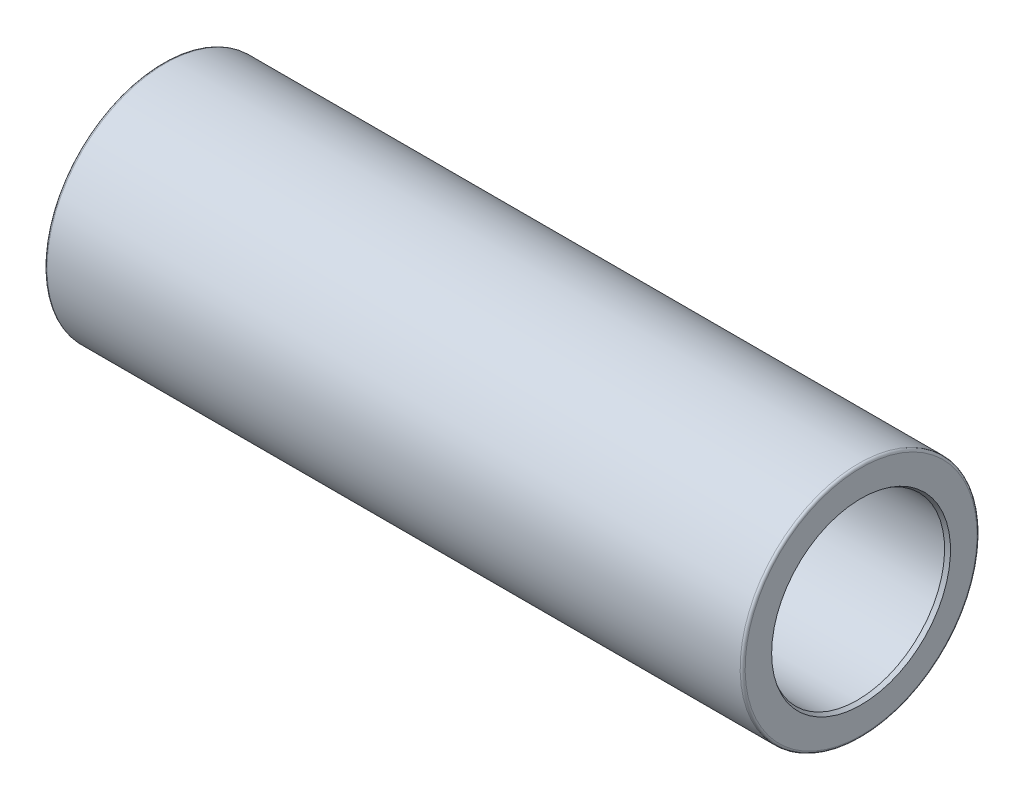
ISO-10303-21;
HEADER;
FILE_DESCRIPTION(('STEP AP214'),'2;1');
FILE_NAME('part.step','',(''),(''),'','','');
FILE_SCHEMA(('AUTOMOTIVE_DESIGN { 1 0 10303 214 1 1 1 1 }'));
ENDSEC;
DATA;
#1=APPLICATION_CONTEXT('core data for automotive mechanical design processes');
#2=APPLICATION_PROTOCOL_DEFINITION('international standard','automotive_design',2000,#1);
#3=PRODUCT_CONTEXT('',#1,'mechanical');
#4=PRODUCT('Part','Part','',(#3));
#5=PRODUCT_RELATED_PRODUCT_CATEGORY('part','',(#4));
#6=PRODUCT_DEFINITION_FORMATION('','',#4);
#7=PRODUCT_DEFINITION_CONTEXT('part definition',#1,'design');
#8=PRODUCT_DEFINITION('design','',#6,#7);
#9=PRODUCT_DEFINITION_SHAPE('','',#8);
#10=(LENGTH_UNIT() NAMED_UNIT(*) SI_UNIT(.MILLI.,.METRE.));
#11=(NAMED_UNIT(*) PLANE_ANGLE_UNIT() SI_UNIT($,.RADIAN.));
#12=(NAMED_UNIT(*) SI_UNIT($,.STERADIAN.) SOLID_ANGLE_UNIT());
#13=UNCERTAINTY_MEASURE_WITH_UNIT(LENGTH_MEASURE(1.E-05),#10,'distance_accuracy_value','');
#14=(GEOMETRIC_REPRESENTATION_CONTEXT(3) GLOBAL_UNCERTAINTY_ASSIGNED_CONTEXT((#13)) GLOBAL_UNIT_ASSIGNED_CONTEXT((#10,
#11,#12)) REPRESENTATION_CONTEXT('',''));
#15=CARTESIAN_POINT('',(0.,0.,0.));
#16=DIRECTION('',(0.,0.,1.));
#17=DIRECTION('',(1.,0.,0.));
#18=AXIS2_PLACEMENT_3D('',#15,#16,#17);
#19=CARTESIAN_POINT('',(-140.,2.22044604925031E-13,0.));
#20=DIRECTION('',(-1.,0.,0.));
#21=DIRECTION('',(0.,-1.,0.));
#22=AXIS2_PLACEMENT_3D('',#19,#20,#21);
#23=CYLINDRICAL_SURFACE('',#22,35.);
#24=CARTESIAN_POINT('',(-73.4626105055054,2.22044604925031E-13,0.));
#25=DIRECTION('',(-1.,0.,0.));
#26=DIRECTION('',(0.,-1.,0.));
#27=AXIS2_PLACEMENT_3D('',#24,#25,#26);
#28=CIRCLE('',#27,35.);
#29=CARTESIAN_POINT('',(-73.4626105055054,-34.9999999999998,0.));
#30=VERTEX_POINT('',#29);
#31=EDGE_CURVE('E10',#30,#30,#28,.T.);
#32=ORIENTED_EDGE('',*,*,#31,.F.);
#33=EDGE_LOOP('',(#32));
#34=FACE_BOUND('',#33,.T.);
#35=CARTESIAN_POINT('',(-138.5,2.22044604925031E-13,0.));
#36=DIRECTION('',(-1.,0.,0.));
#37=DIRECTION('',(0.,0.,1.));
#38=AXIS2_PLACEMENT_3D('',#35,#36,#37);
#39=CIRCLE('',#38,35.);
#40=CARTESIAN_POINT('',(-138.5,2.22044604925031E-13,35.0000000000001));
#41=VERTEX_POINT('',#40);
#42=EDGE_CURVE('E112',#41,#41,#39,.T.);
#43=ORIENTED_EDGE('',*,*,#42,.T.);
#44=EDGE_LOOP('',(#43));
#45=FACE_BOUND('',#44,.T.);
#46=ADVANCED_FACE('F39',(#34,#45),#23,.F.);
#47=CARTESIAN_POINT('',(-140.,35.0000000000001,0.));
#48=DIRECTION('',(-1.,0.,0.));
#49=DIRECTION('',(0.,-1.,0.));
#50=AXIS2_PLACEMENT_3D('',#47,#48,#49);
#51=PLANE('',#50);
#52=CARTESIAN_POINT('',(-140.,2.22044604925031E-13,0.));
#53=DIRECTION('',(-1.,0.,0.));
#54=DIRECTION('',(0.,-1.,0.));
#55=AXIS2_PLACEMENT_3D('',#52,#53,#54);
#56=CIRCLE('',#55,46.5);
#57=CARTESIAN_POINT('',(-140.,-46.4999999999999,0.));
#58=VERTEX_POINT('',#57);
#59=EDGE_CURVE('E103',#58,#58,#56,.T.);
#60=ORIENTED_EDGE('',*,*,#59,.T.);
#61=EDGE_LOOP('',(#60));
#62=FACE_BOUND('',#61,.T.);
#63=CARTESIAN_POINT('',(-140.,2.22044604925031E-13,0.));
#64=DIRECTION('',(-1.,0.,0.));
#65=DIRECTION('',(0.,0.,1.));
#66=AXIS2_PLACEMENT_3D('',#63,#64,#65);
#67=CIRCLE('',#66,35.8660254037845);
#68=CARTESIAN_POINT('',(-140.,2.22044604925031E-13,35.8660254037845));
#69=VERTEX_POINT('',#68);
#70=EDGE_CURVE('E115',#69,#69,#67,.T.);
#71=ORIENTED_EDGE('',*,*,#70,.F.);
#72=EDGE_LOOP('',(#71));
#73=FACE_BOUND('',#72,.T.);
#74=ADVANCED_FACE('F122',(#62,#73),#51,.T.);
#75=CARTESIAN_POINT('',(-140.,2.22044604925031E-13,0.));
#76=DIRECTION('',(-1.,0.,0.));
#77=DIRECTION('',(0.,-1.,0.));
#78=AXIS2_PLACEMENT_3D('',#75,#76,#77);
#79=CYLINDRICAL_SURFACE('',#78,35.);
#80=CARTESIAN_POINT('',(73.462610505505,1.11022302462516E-13,2.22044604925031E-13));
#81=DIRECTION('',(-1.,0.,0.));
#82=DIRECTION('',(0.,-1.,0.));
#83=AXIS2_PLACEMENT_3D('',#80,#81,#82);
#84=CIRCLE('',#83,35.);
#85=CARTESIAN_POINT('',(73.462610505505,-35.,2.14273043752655E-13));
#86=VERTEX_POINT('',#85);
#87=EDGE_CURVE('E91',#86,#86,#84,.T.);
#88=ORIENTED_EDGE('',*,*,#87,.T.);
#89=EDGE_LOOP('',(#88));
#90=FACE_BOUND('',#89,.T.);
#91=CARTESIAN_POINT('',(138.5,3.33066907387547E-13,0.));
#92=DIRECTION('',(-1.,0.,0.));
#93=DIRECTION('',(0.,0.,1.));
#94=AXIS2_PLACEMENT_3D('',#91,#92,#93);
#95=CIRCLE('',#94,35.);
#96=CARTESIAN_POINT('',(138.5,3.33066907387547E-13,35.0000000000001));
#97=VERTEX_POINT('',#96);
#98=EDGE_CURVE('E109',#97,#97,#95,.T.);
#99=ORIENTED_EDGE('',*,*,#98,.F.);
#100=EDGE_LOOP('',(#99));
#101=FACE_BOUND('',#100,.T.);
#102=ADVANCED_FACE('F124',(#90,#101),#79,.F.);
#103=CARTESIAN_POINT('',(140.,35.,0.));
#104=DIRECTION('',(-1.,0.,0.));
#105=DIRECTION('',(0.,-1.,0.));
#106=AXIS2_PLACEMENT_3D('',#103,#104,#105);
#107=PLANE('',#106);
#108=CARTESIAN_POINT('',(140.,1.11022302462516E-13,2.22044604925031E-13));
#109=DIRECTION('',(-1.,0.,0.));
#110=DIRECTION('',(0.,-1.,0.));
#111=AXIS2_PLACEMENT_3D('',#108,#109,#110);
#112=CIRCLE('',#111,46.5);
#113=CARTESIAN_POINT('',(140.,-46.5,2.11719530796017E-13));
#114=VERTEX_POINT('',#113);
#115=EDGE_CURVE('E94',#114,#114,#112,.T.);
#116=ORIENTED_EDGE('',*,*,#115,.F.);
#117=EDGE_LOOP('',(#116));
#118=FACE_BOUND('',#117,.T.);
#119=CARTESIAN_POINT('',(140.,1.11022302462516E-13,2.22044604925031E-13));
#120=DIRECTION('',(-1.,0.,0.));
#121=DIRECTION('',(0.,0.,1.));
#122=AXIS2_PLACEMENT_3D('',#119,#120,#121);
#123=CIRCLE('',#122,35.8660254037845);
#124=CARTESIAN_POINT('',(140.,1.11022302462516E-13,35.8660254037848));
#125=VERTEX_POINT('',#124);
#126=EDGE_CURVE('E106',#125,#125,#123,.T.);
#127=ORIENTED_EDGE('',*,*,#126,.T.);
#128=EDGE_LOOP('',(#127));
#129=FACE_BOUND('',#128,.T.);
#130=ADVANCED_FACE('F131',(#118,#129),#107,.F.);
#131=CARTESIAN_POINT('',(-73.4626105055054,2.22044604925031E-13,0.));
#132=DIRECTION('',(1.,0.,0.));
#133=DIRECTION('',(0.,1.,0.));
#134=AXIS2_PLACEMENT_3D('',#131,#132,#133);
#135=CONICAL_SURFACE('',#134,35.,0.471238898038471);
#136=CARTESIAN_POINT('',(-71.5000000000001,2.22044604925031E-13,0.));
#137=DIRECTION('',(-1.,0.,0.));
#138=DIRECTION('',(0.,-1.,0.));
#139=AXIS2_PLACEMENT_3D('',#136,#137,#138);
#140=CIRCLE('',#139,36.);
#141=CARTESIAN_POINT('',(-71.5000000000001,-35.9999999999998,0.));
#142=VERTEX_POINT('',#141);
#143=EDGE_CURVE('E45',#142,#142,#140,.T.);
#144=ORIENTED_EDGE('',*,*,#143,.F.);
#145=EDGE_LOOP('',(#144));
#146=FACE_BOUND('',#145,.T.);
#147=ORIENTED_EDGE('',*,*,#31,.T.);
#148=EDGE_LOOP('',(#147));
#149=FACE_BOUND('',#148,.T.);
#150=ADVANCED_FACE('F153',(#146,#149),#135,.F.);
#151=CARTESIAN_POINT('',(-140.,2.22044604925031E-13,0.));
#152=DIRECTION('',(-1.,0.,0.));
#153=DIRECTION('',(0.,-1.,0.));
#154=AXIS2_PLACEMENT_3D('',#151,#152,#153);
#155=CYLINDRICAL_SURFACE('',#154,36.);
#156=CARTESIAN_POINT('',(-69.5000000000003,2.22044604925031E-13,0.));
#157=DIRECTION('',(-1.,0.,0.));
#158=DIRECTION('',(0.,-1.,0.));
#159=AXIS2_PLACEMENT_3D('',#156,#157,#158);
#160=CIRCLE('',#159,36.);
#161=CARTESIAN_POINT('',(-69.5000000000003,-35.9999999999998,0.));
#162=VERTEX_POINT('',#161);
#163=EDGE_CURVE('E49',#162,#162,#160,.T.);
#164=ORIENTED_EDGE('',*,*,#163,.F.);
#165=EDGE_LOOP('',(#164));
#166=FACE_BOUND('',#165,.T.);
#167=ORIENTED_EDGE('',*,*,#143,.T.);
#168=EDGE_LOOP('',(#167));
#169=FACE_BOUND('',#168,.T.);
#170=ADVANCED_FACE('F206',(#166,#169),#155,.F.);
#171=CARTESIAN_POINT('',(-69.5000000000002,36.0000000000001,-2.22044604925031E-13));
#172=DIRECTION('',(1.,0.,0.));
#173=DIRECTION('',(0.,1.,0.));
#174=AXIS2_PLACEMENT_3D('',#171,#172,#173);
#175=PLANE('',#174);
#176=CARTESIAN_POINT('',(-69.5000000000003,2.22044604925031E-13,0.));
#177=DIRECTION('',(-1.,0.,0.));
#178=DIRECTION('',(0.,-1.,0.));
#179=AXIS2_PLACEMENT_3D('',#176,#177,#178);
#180=CIRCLE('',#179,34.);
#181=CARTESIAN_POINT('',(-69.5000000000003,-33.9999999999998,0.));
#182=VERTEX_POINT('',#181);
#183=EDGE_CURVE('E53',#182,#182,#180,.T.);
#184=ORIENTED_EDGE('',*,*,#183,.F.);
#185=EDGE_LOOP('',(#184));
#186=FACE_BOUND('',#185,.T.);
#187=ORIENTED_EDGE('',*,*,#163,.T.);
#188=EDGE_LOOP('',(#187));
#189=FACE_BOUND('',#188,.T.);
#190=ADVANCED_FACE('F202',(#186,#189),#175,.F.);
#191=CARTESIAN_POINT('',(-140.,2.22044604925031E-13,0.));
#192=DIRECTION('',(-1.,0.,0.));
#193=DIRECTION('',(0.,-1.,0.));
#194=AXIS2_PLACEMENT_3D('',#191,#192,#193);
#195=CYLINDRICAL_SURFACE('',#194,34.);
#196=CARTESIAN_POINT('',(-60.1763269807087,2.22044604925031E-13,-2.22044604925031E-13));
#197=DIRECTION('',(-1.,0.,0.));
#198=DIRECTION('',(0.,-1.,0.));
#199=AXIS2_PLACEMENT_3D('',#196,#197,#198);
#200=CIRCLE('',#199,34.);
#201=CARTESIAN_POINT('',(-60.1763269807087,-33.9999999999998,-2.29594121492482E-13));
#202=VERTEX_POINT('',#201);
#203=EDGE_CURVE('E58',#202,#202,#200,.T.);
#204=ORIENTED_EDGE('',*,*,#203,.F.);
#205=EDGE_LOOP('',(#204));
#206=FACE_BOUND('',#205,.T.);
#207=ORIENTED_EDGE('',*,*,#183,.T.);
#208=EDGE_LOOP('',(#207));
#209=FACE_BOUND('',#208,.T.);
#210=ADVANCED_FACE('F198',(#206,#209),#195,.F.);
#211=CARTESIAN_POINT('',(-60.1763269807087,2.22044604925031E-13,-2.22044604925031E-13));
#212=DIRECTION('',(-1.,0.,0.));
#213=DIRECTION('',(0.,-1.,0.));
#214=AXIS2_PLACEMENT_3D('',#211,#212,#213);
#215=TOROIDAL_SURFACE('',#214,35.,0.999999999999994);
#216=CARTESIAN_POINT('',(-59.834306837383,0.,0.));
#217=DIRECTION('',(-1.,0.,0.));
#218=DIRECTION('',(0.,-1.,0.));
#219=AXIS2_PLACEMENT_3D('',#216,#217,#218);
#220=CIRCLE('',#219,34.0603073792141);
#221=CARTESIAN_POINT('',(-59.834306837383,-34.0603073792142,0.));
#222=VERTEX_POINT('',#221);
#223=EDGE_CURVE('E61',#222,#222,#220,.T.);
#224=ORIENTED_EDGE('',*,*,#223,.F.);
#225=EDGE_LOOP('',(#224));
#226=FACE_BOUND('',#225,.T.);
#227=ORIENTED_EDGE('',*,*,#203,.T.);
#228=EDGE_LOOP('',(#227));
#229=FACE_BOUND('',#228,.T.);
#230=ADVANCED_FACE('F194',(#226,#229),#215,.T.);
#231=CARTESIAN_POINT('',(-59.834306837383,0.,0.));
#232=DIRECTION('',(1.,0.,0.));
#233=DIRECTION('',(0.,1.,0.));
#234=AXIS2_PLACEMENT_3D('',#231,#232,#233);
#235=CONICAL_SURFACE('',#234,34.0603073792141,0.349065850398866);
#236=CARTESIAN_POINT('',(-50.5495221945265,0.,0.));
#237=DIRECTION('',(-1.,0.,0.));
#238=DIRECTION('',(0.,-1.,0.));
#239=AXIS2_PLACEMENT_3D('',#236,#237,#238);
#240=CIRCLE('',#239,37.4396926207859);
#241=CARTESIAN_POINT('',(-50.5495221945265,-37.439692620786,0.));
#242=VERTEX_POINT('',#241);
#243=EDGE_CURVE('E64',#242,#242,#240,.T.);
#244=ORIENTED_EDGE('',*,*,#243,.F.);
#245=EDGE_LOOP('',(#244));
#246=FACE_BOUND('',#245,.T.);
#247=ORIENTED_EDGE('',*,*,#223,.T.);
#248=EDGE_LOOP('',(#247));
#249=FACE_BOUND('',#248,.T.);
#250=ADVANCED_FACE('F190',(#246,#249),#235,.F.);
#251=CARTESIAN_POINT('',(-50.2075020512005,2.22044604925031E-13,0.));
#252=DIRECTION('',(-1.,0.,0.));
#253=DIRECTION('',(0.,-1.,0.));
#254=AXIS2_PLACEMENT_3D('',#251,#252,#253);
#255=TOROIDAL_SURFACE('',#254,36.5,1.);
#256=ORIENTED_EDGE('',*,*,#243,.T.);
#257=EDGE_LOOP('',(#256));
#258=FACE_BOUND('',#257,.T.);
#259=CARTESIAN_POINT('',(-50.2075020512005,2.22044604925031E-13,0.));
#260=DIRECTION('',(-1.,0.,0.));
#261=DIRECTION('',(0.,-1.,0.));
#262=AXIS2_PLACEMENT_3D('',#259,#260,#261);
#263=CIRCLE('',#262,37.5);
#264=CARTESIAN_POINT('',(-50.2075020512005,-37.4999999999998,0.));
#265=VERTEX_POINT('',#264);
#266=EDGE_CURVE('E67',#265,#265,#263,.T.);
#267=ORIENTED_EDGE('',*,*,#266,.F.);
#268=EDGE_LOOP('',(#267));
#269=FACE_BOUND('',#268,.T.);
#270=ADVANCED_FACE('F186',(#258,#269),#255,.F.);
#271=CARTESIAN_POINT('',(-140.,2.22044604925031E-13,0.));
#272=DIRECTION('',(-1.,0.,0.));
#273=DIRECTION('',(0.,-1.,0.));
#274=AXIS2_PLACEMENT_3D('',#271,#272,#273);
#275=CYLINDRICAL_SURFACE('',#274,37.5);
#276=CARTESIAN_POINT('',(50.2075020512003,1.11022302462516E-13,2.22044604925031E-13));
#277=DIRECTION('',(-1.,0.,0.));
#278=DIRECTION('',(0.,-1.,0.));
#279=AXIS2_PLACEMENT_3D('',#276,#277,#278);
#280=CIRCLE('',#279,37.5);
#281=CARTESIAN_POINT('',(50.2075020512003,-37.5,2.13717932240343E-13));
#282=VERTEX_POINT('',#281);
#283=EDGE_CURVE('E70',#282,#282,#280,.T.);
#284=ORIENTED_EDGE('',*,*,#283,.F.);
#285=EDGE_LOOP('',(#284));
#286=FACE_BOUND('',#285,.T.);
#287=ORIENTED_EDGE('',*,*,#266,.T.);
#288=EDGE_LOOP('',(#287));
#289=FACE_BOUND('',#288,.T.);
#290=ADVANCED_FACE('F182',(#286,#289),#275,.F.);
#291=CARTESIAN_POINT('',(50.2075020512003,1.11022302462516E-13,2.22044604925031E-13));
#292=DIRECTION('',(-1.,0.,0.));
#293=DIRECTION('',(0.,-1.,0.));
#294=AXIS2_PLACEMENT_3D('',#291,#292,#293);
#295=TOROIDAL_SURFACE('',#294,36.5,1.);
#296=CARTESIAN_POINT('',(50.549522194526,3.33066907387547E-13,0.));
#297=DIRECTION('',(-1.,0.,0.));
#298=DIRECTION('',(0.,-1.,0.));
#299=AXIS2_PLACEMENT_3D('',#296,#297,#298);
#300=CIRCLE('',#299,37.4396926207859);
#301=CARTESIAN_POINT('',(50.549522194526,-37.4396926207856,0.));
#302=VERTEX_POINT('',#301);
#303=EDGE_CURVE('E73',#302,#302,#300,.T.);
#304=ORIENTED_EDGE('',*,*,#303,.F.);
#305=EDGE_LOOP('',(#304));
#306=FACE_BOUND('',#305,.T.);
#307=ORIENTED_EDGE('',*,*,#283,.T.);
#308=EDGE_LOOP('',(#307));
#309=FACE_BOUND('',#308,.T.);
#310=ADVANCED_FACE('F178',(#306,#309),#295,.F.);
#311=CARTESIAN_POINT('',(59.8343068373828,0.,0.));
#312=DIRECTION('',(-1.,0.,0.));
#313=DIRECTION('',(0.,-1.,0.));
#314=AXIS2_PLACEMENT_3D('',#311,#312,#313);
#315=CONICAL_SURFACE('',#314,34.0603073792141,0.349065850398867);
#316=ORIENTED_EDGE('',*,*,#303,.T.);
#317=EDGE_LOOP('',(#316));
#318=FACE_BOUND('',#317,.T.);
#319=CARTESIAN_POINT('',(59.8343068373828,0.,0.));
#320=DIRECTION('',(-1.,0.,0.));
#321=DIRECTION('',(0.,-1.,0.));
#322=AXIS2_PLACEMENT_3D('',#319,#320,#321);
#323=CIRCLE('',#322,34.0603073792141);
#324=CARTESIAN_POINT('',(59.8343068373828,-34.0603073792142,0.));
#325=VERTEX_POINT('',#324);
#326=EDGE_CURVE('E76',#325,#325,#323,.T.);
#327=ORIENTED_EDGE('',*,*,#326,.F.);
#328=EDGE_LOOP('',(#327));
#329=FACE_BOUND('',#328,.T.);
#330=ADVANCED_FACE('F174',(#318,#329),#315,.F.);
#331=CARTESIAN_POINT('',(60.1763269807083,1.11022302462516E-13,2.22044604925031E-13));
#332=DIRECTION('',(-1.,0.,0.));
#333=DIRECTION('',(0.,-1.,0.));
#334=AXIS2_PLACEMENT_3D('',#331,#332,#333);
#335=TOROIDAL_SURFACE('',#334,35.,0.999999999999994);
#336=ORIENTED_EDGE('',*,*,#326,.T.);
#337=EDGE_LOOP('',(#336));
#338=FACE_BOUND('',#337,.T.);
#339=CARTESIAN_POINT('',(60.1763269807083,1.11022302462516E-13,2.22044604925031E-13));
#340=DIRECTION('',(-1.,0.,0.));
#341=DIRECTION('',(0.,-1.,0.));
#342=AXIS2_PLACEMENT_3D('',#339,#340,#341);
#343=CIRCLE('',#342,34.);
#344=CARTESIAN_POINT('',(60.1763269807083,-34.,2.1449508835758E-13));
#345=VERTEX_POINT('',#344);
#346=EDGE_CURVE('E79',#345,#345,#343,.T.);
#347=ORIENTED_EDGE('',*,*,#346,.F.);
#348=EDGE_LOOP('',(#347));
#349=FACE_BOUND('',#348,.T.);
#350=ADVANCED_FACE('F170',(#338,#349),#335,.T.);
#351=CARTESIAN_POINT('',(-140.,2.22044604925031E-13,0.));
#352=DIRECTION('',(-1.,0.,0.));
#353=DIRECTION('',(0.,-1.,0.));
#354=AXIS2_PLACEMENT_3D('',#351,#352,#353);
#355=CYLINDRICAL_SURFACE('',#354,34.);
#356=CARTESIAN_POINT('',(69.5000000000001,1.11022302462516E-13,2.22044604925031E-13));
#357=DIRECTION('',(-1.,0.,0.));
#358=DIRECTION('',(0.,-1.,0.));
#359=AXIS2_PLACEMENT_3D('',#356,#357,#358);
#360=CIRCLE('',#359,34.);
#361=CARTESIAN_POINT('',(69.5000000000001,-33.9999999999999,2.1449508835758E-13));
#362=VERTEX_POINT('',#361);
#363=EDGE_CURVE('E82',#362,#362,#360,.T.);
#364=ORIENTED_EDGE('',*,*,#363,.F.);
#365=EDGE_LOOP('',(#364));
#366=FACE_BOUND('',#365,.T.);
#367=ORIENTED_EDGE('',*,*,#346,.T.);
#368=EDGE_LOOP('',(#367));
#369=FACE_BOUND('',#368,.T.);
#370=ADVANCED_FACE('F166',(#366,#369),#355,.F.);
#371=CARTESIAN_POINT('',(69.5000000000001,36.,0.));
#372=DIRECTION('',(1.,0.,0.));
#373=DIRECTION('',(0.,1.,0.));
#374=AXIS2_PLACEMENT_3D('',#371,#372,#373);
#375=PLANE('',#374);
#376=ORIENTED_EDGE('',*,*,#363,.T.);
#377=EDGE_LOOP('',(#376));
#378=FACE_BOUND('',#377,.T.);
#379=CARTESIAN_POINT('',(69.5000000000001,1.11022302462516E-13,2.22044604925031E-13));
#380=DIRECTION('',(-1.,0.,0.));
#381=DIRECTION('',(0.,-1.,0.));
#382=AXIS2_PLACEMENT_3D('',#379,#380,#381);
#383=CIRCLE('',#382,36.);
#384=CARTESIAN_POINT('',(69.5000000000001,-35.9999999999999,2.1405099914773E-13));
#385=VERTEX_POINT('',#384);
#386=EDGE_CURVE('E85',#385,#385,#383,.T.);
#387=ORIENTED_EDGE('',*,*,#386,.F.);
#388=EDGE_LOOP('',(#387));
#389=FACE_BOUND('',#388,.T.);
#390=ADVANCED_FACE('F162',(#378,#389),#375,.T.);
#391=CARTESIAN_POINT('',(-140.,2.22044604925031E-13,0.));
#392=DIRECTION('',(-1.,0.,0.));
#393=DIRECTION('',(0.,-1.,0.));
#394=AXIS2_PLACEMENT_3D('',#391,#392,#393);
#395=CYLINDRICAL_SURFACE('',#394,36.);
#396=ORIENTED_EDGE('',*,*,#386,.T.);
#397=EDGE_LOOP('',(#396));
#398=FACE_BOUND('',#397,.T.);
#399=CARTESIAN_POINT('',(71.4999999999999,1.11022302462516E-13,2.22044604925031E-13));
#400=DIRECTION('',(-1.,0.,0.));
#401=DIRECTION('',(0.,-1.,0.));
#402=AXIS2_PLACEMENT_3D('',#399,#400,#401);
#403=CIRCLE('',#402,36.);
#404=CARTESIAN_POINT('',(71.4999999999999,-35.9999999999999,2.1405099914773E-13));
#405=VERTEX_POINT('',#404);
#406=EDGE_CURVE('E88',#405,#405,#403,.T.);
#407=ORIENTED_EDGE('',*,*,#406,.F.);
#408=EDGE_LOOP('',(#407));
#409=FACE_BOUND('',#408,.T.);
#410=ADVANCED_FACE('F158',(#398,#409),#395,.F.);
#411=CARTESIAN_POINT('',(73.462610505505,1.11022302462516E-13,2.22044604925031E-13));
#412=DIRECTION('',(-1.,0.,0.));
#413=DIRECTION('',(0.,-1.,0.));
#414=AXIS2_PLACEMENT_3D('',#411,#412,#413);
#415=CONICAL_SURFACE('',#414,35.,0.471238898038468);
#416=ORIENTED_EDGE('',*,*,#406,.T.);
#417=EDGE_LOOP('',(#416));
#418=FACE_BOUND('',#417,.T.);
#419=ORIENTED_EDGE('',*,*,#87,.F.);
#420=EDGE_LOOP('',(#419));
#421=FACE_BOUND('',#420,.T.);
#422=ADVANCED_FACE('F150',(#418,#421),#415,.F.);
#423=CARTESIAN_POINT('',(139.,1.11022302462516E-13,2.22044604925031E-13));
#424=DIRECTION('',(-1.,0.,0.));
#425=DIRECTION('',(0.,-1.,0.));
#426=AXIS2_PLACEMENT_3D('',#423,#424,#425);
#427=TOROIDAL_SURFACE('',#426,46.5,1.);
#428=ORIENTED_EDGE('',*,*,#115,.T.);
#429=EDGE_LOOP('',(#428));
#430=FACE_BOUND('',#429,.T.);
#431=CARTESIAN_POINT('',(139.,1.11022302462516E-13,2.22044604925031E-13));
#432=DIRECTION('',(-1.,0.,0.));
#433=DIRECTION('',(0.,-1.,0.));
#434=AXIS2_PLACEMENT_3D('',#431,#432,#433);
#435=CIRCLE('',#434,47.5);
#436=CARTESIAN_POINT('',(139.,-47.5,2.11497486191092E-13));
#437=VERTEX_POINT('',#436);
#438=EDGE_CURVE('E97',#437,#437,#435,.T.);
#439=ORIENTED_EDGE('',*,*,#438,.F.);
#440=EDGE_LOOP('',(#439));
#441=FACE_BOUND('',#440,.T.);
#442=ADVANCED_FACE('F146',(#430,#441),#427,.T.);
#443=CARTESIAN_POINT('',(-140.,2.22044604925031E-13,0.));
#444=DIRECTION('',(-1.,0.,0.));
#445=DIRECTION('',(0.,-1.,0.));
#446=AXIS2_PLACEMENT_3D('',#443,#444,#445);
#447=CYLINDRICAL_SURFACE('',#446,47.5);
#448=ORIENTED_EDGE('',*,*,#438,.T.);
#449=EDGE_LOOP('',(#448));
#450=FACE_BOUND('',#449,.T.);
#451=CARTESIAN_POINT('',(-139.,0.,0.));
#452=DIRECTION('',(-1.,0.,0.));
#453=DIRECTION('',(0.,-1.,0.));
#454=AXIS2_PLACEMENT_3D('',#451,#452,#453);
#455=CIRCLE('',#454,47.5);
#456=CARTESIAN_POINT('',(-139.,-47.5000000000001,0.));
#457=VERTEX_POINT('',#456);
#458=EDGE_CURVE('E100',#457,#457,#455,.T.);
#459=ORIENTED_EDGE('',*,*,#458,.F.);
#460=EDGE_LOOP('',(#459));
#461=FACE_BOUND('',#460,.T.);
#462=ADVANCED_FACE('F142',(#450,#461),#447,.T.);
#463=CARTESIAN_POINT('',(-139.,0.,0.));
#464=DIRECTION('',(-1.,0.,0.));
#465=DIRECTION('',(0.,-1.,0.));
#466=AXIS2_PLACEMENT_3D('',#463,#464,#465);
#467=TOROIDAL_SURFACE('',#466,46.5,1.);
#468=ORIENTED_EDGE('',*,*,#59,.F.);
#469=EDGE_LOOP('',(#468));
#470=FACE_BOUND('',#469,.T.);
#471=ORIENTED_EDGE('',*,*,#458,.T.);
#472=EDGE_LOOP('',(#471));
#473=FACE_BOUND('',#472,.T.);
#474=ADVANCED_FACE('F139',(#470,#473),#467,.T.);
#475=CARTESIAN_POINT('',(140.,1.11022302462516E-13,2.22044604925031E-13));
#476=DIRECTION('',(1.,0.,0.));
#477=DIRECTION('',(0.,0.,-1.));
#478=AXIS2_PLACEMENT_3D('',#475,#476,#477);
#479=CONICAL_SURFACE('',#478,35.8660254037845,0.523598775598301);
#480=ORIENTED_EDGE('',*,*,#98,.T.);
#481=EDGE_LOOP('',(#480));
#482=FACE_BOUND('',#481,.T.);
#483=ORIENTED_EDGE('',*,*,#126,.F.);
#484=EDGE_LOOP('',(#483));
#485=FACE_BOUND('',#484,.T.);
#486=ADVANCED_FACE('F137',(#482,#485),#479,.F.);
#487=CARTESIAN_POINT('',(-138.5,2.22044604925031E-13,0.));
#488=DIRECTION('',(-1.,0.,0.));
#489=DIRECTION('',(0.,0.,1.));
#490=AXIS2_PLACEMENT_3D('',#487,#488,#489);
#491=CONICAL_SURFACE('',#490,35.,0.523598775598301);
#492=ORIENTED_EDGE('',*,*,#70,.T.);
#493=EDGE_LOOP('',(#492));
#494=FACE_BOUND('',#493,.T.);
#495=ORIENTED_EDGE('',*,*,#42,.F.);
#496=EDGE_LOOP('',(#495));
#497=FACE_BOUND('',#496,.T.);
#498=ADVANCED_FACE('F119',(#494,#497),#491,.F.);
#499=CLOSED_SHELL('',(#46,#74,#102,#130,#150,#170,#190,#210,#230,#250,#270,#290,#310,#330,#350,
#370,#390,#410,#422,#442,#462,#474,#486,#498));
#500=MANIFOLD_SOLID_BREP('B2',#499);
#501=ADVANCED_BREP_SHAPE_REPRESENTATION('',(#18,#500),#14);
#502=SHAPE_DEFINITION_REPRESENTATION(#9,#501);
ENDSEC;
END-ISO-10303-21;
